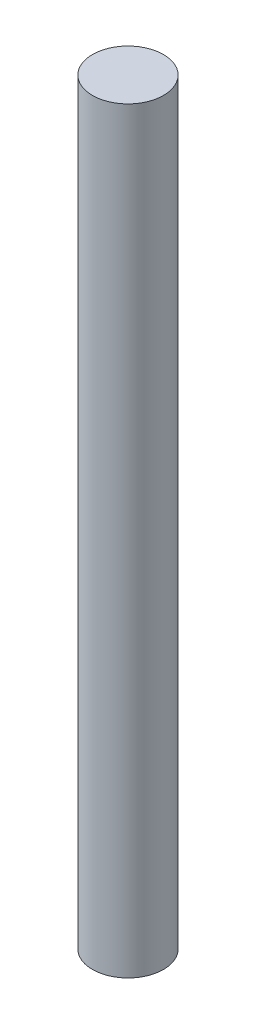
ISO-10303-21;
HEADER;
FILE_DESCRIPTION(('STEP AP214'),'2;1');
FILE_NAME('part.step','',(''),(''),'','','');
FILE_SCHEMA(('AUTOMOTIVE_DESIGN { 1 0 10303 214 1 1 1 1 }'));
ENDSEC;
DATA;
#1=APPLICATION_CONTEXT('core data for automotive mechanical design processes');
#2=APPLICATION_PROTOCOL_DEFINITION('international standard','automotive_design',2000,#1);
#3=PRODUCT_CONTEXT('',#1,'mechanical');
#4=PRODUCT('Part','Part','',(#3));
#5=PRODUCT_RELATED_PRODUCT_CATEGORY('part','',(#4));
#6=PRODUCT_DEFINITION_FORMATION('','',#4);
#7=PRODUCT_DEFINITION_CONTEXT('part definition',#1,'design');
#8=PRODUCT_DEFINITION('design','',#6,#7);
#9=PRODUCT_DEFINITION_SHAPE('','',#8);
#10=(LENGTH_UNIT() NAMED_UNIT(*) SI_UNIT(.MILLI.,.METRE.));
#11=(NAMED_UNIT(*) PLANE_ANGLE_UNIT() SI_UNIT($,.RADIAN.));
#12=(NAMED_UNIT(*) SI_UNIT($,.STERADIAN.) SOLID_ANGLE_UNIT());
#13=UNCERTAINTY_MEASURE_WITH_UNIT(LENGTH_MEASURE(1.E-05),#10,'distance_accuracy_value','');
#14=(GEOMETRIC_REPRESENTATION_CONTEXT(3) GLOBAL_UNCERTAINTY_ASSIGNED_CONTEXT((#13)) GLOBAL_UNIT_ASSIGNED_CONTEXT((#10,
#11,#12)) REPRESENTATION_CONTEXT('',''));
#15=CARTESIAN_POINT('',(0.,0.,0.));
#16=DIRECTION('',(0.,0.,1.));
#17=DIRECTION('',(1.,0.,0.));
#18=AXIS2_PLACEMENT_3D('',#15,#16,#17);
#19=CARTESIAN_POINT('',(0.,50.8,0.));
#20=DIRECTION('',(0.,-1.,0.));
#21=DIRECTION('',(0.,0.,-1.));
#22=AXIS2_PLACEMENT_3D('',#19,#20,#21);
#23=CYLINDRICAL_SURFACE('',#22,4.7625);
#24=CARTESIAN_POINT('',(0.,50.8,0.));
#25=DIRECTION('',(0.,1.,0.));
#26=DIRECTION('',(0.,0.,1.));
#27=AXIS2_PLACEMENT_3D('',#24,#25,#26);
#28=CIRCLE('',#27,4.7625);
#29=CARTESIAN_POINT('',(0.,50.8,4.7625));
#30=VERTEX_POINT('',#29);
#31=EDGE_CURVE('E10',#30,#30,#28,.T.);
#32=ORIENTED_EDGE('',*,*,#31,.F.);
#33=EDGE_LOOP('',(#32));
#34=FACE_BOUND('',#33,.T.);
#35=CARTESIAN_POINT('',(0.,-50.8,0.));
#36=DIRECTION('',(0.,1.,0.));
#37=DIRECTION('',(0.,0.,1.));
#38=AXIS2_PLACEMENT_3D('',#35,#36,#37);
#39=CIRCLE('',#38,4.7625);
#40=CARTESIAN_POINT('',(0.,-50.8,4.7625));
#41=VERTEX_POINT('',#40);
#42=EDGE_CURVE('E40',#41,#41,#39,.T.);
#43=ORIENTED_EDGE('',*,*,#42,.T.);
#44=EDGE_LOOP('',(#43));
#45=FACE_BOUND('',#44,.T.);
#46=ADVANCED_FACE('F37',(#34,#45),#23,.T.);
#47=CARTESIAN_POINT('',(0.,50.8,0.));
#48=DIRECTION('',(0.,1.,0.));
#49=DIRECTION('',(0.,0.,1.));
#50=AXIS2_PLACEMENT_3D('',#47,#48,#49);
#51=PLANE('',#50);
#52=ORIENTED_EDGE('',*,*,#31,.T.);
#53=EDGE_LOOP('',(#52));
#54=FACE_BOUND('',#53,.T.);
#55=ADVANCED_FACE('F52',(#54),#51,.T.);
#56=CARTESIAN_POINT('',(0.,-50.8,0.));
#57=DIRECTION('',(0.,1.,0.));
#58=DIRECTION('',(0.,0.,1.));
#59=AXIS2_PLACEMENT_3D('',#56,#57,#58);
#60=PLANE('',#59);
#61=ORIENTED_EDGE('',*,*,#42,.F.);
#62=EDGE_LOOP('',(#61));
#63=FACE_BOUND('',#62,.T.);
#64=ADVANCED_FACE('F50',(#63),#60,.F.);
#65=CLOSED_SHELL('',(#46,#55,#64));
#66=MANIFOLD_SOLID_BREP('B2',#65);
#67=ADVANCED_BREP_SHAPE_REPRESENTATION('',(#18,#66),#14);
#68=SHAPE_DEFINITION_REPRESENTATION(#9,#67);
ENDSEC;
END-ISO-10303-21;
